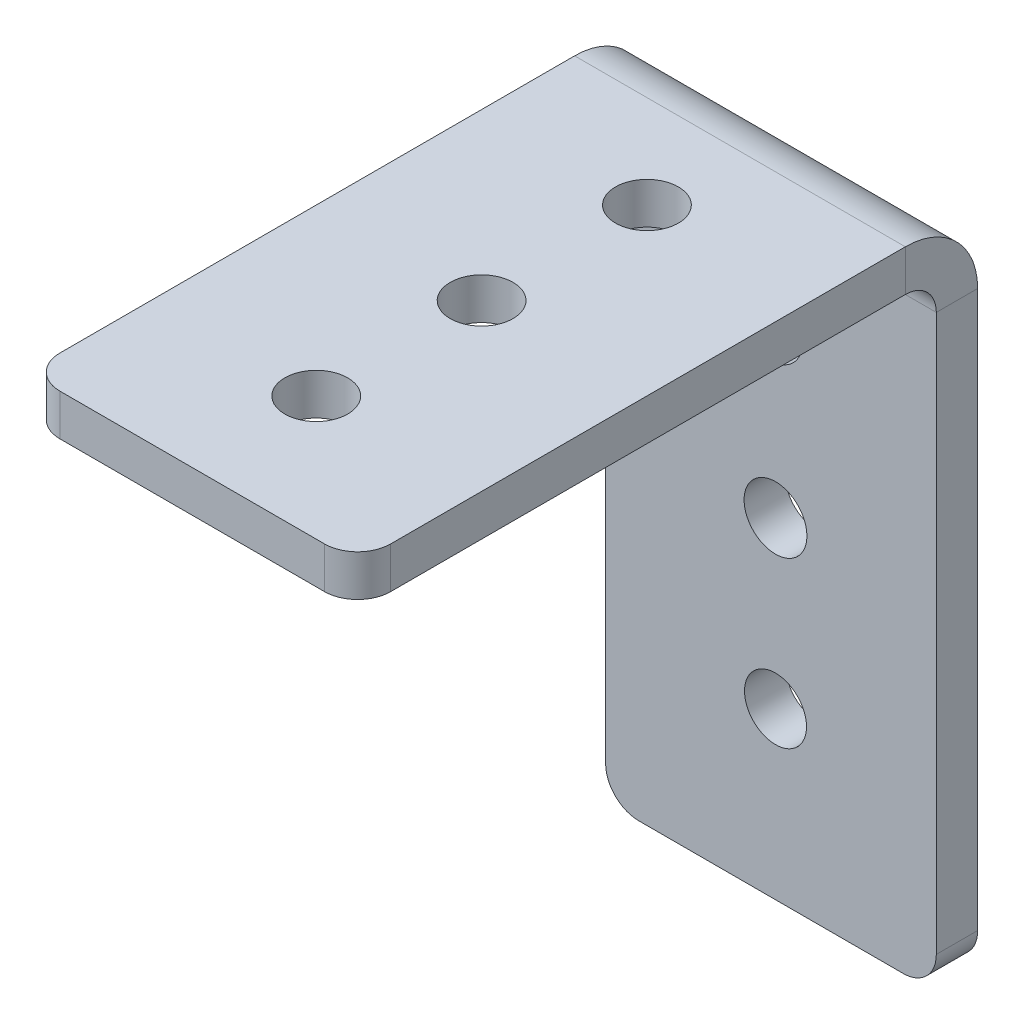
ISO-10303-21;
HEADER;
FILE_DESCRIPTION(('STEP AP214'),'2;1');
FILE_NAME('part.step','',(''),(''),'','','');
FILE_SCHEMA(('AUTOMOTIVE_DESIGN { 1 0 10303 214 1 1 1 1 }'));
ENDSEC;
DATA;
#1=APPLICATION_CONTEXT('core data for automotive mechanical design processes');
#2=APPLICATION_PROTOCOL_DEFINITION('international standard','automotive_design',2000,#1);
#3=PRODUCT_CONTEXT('',#1,'mechanical');
#4=PRODUCT('Part','Part','',(#3));
#5=PRODUCT_RELATED_PRODUCT_CATEGORY('part','',(#4));
#6=PRODUCT_DEFINITION_FORMATION('','',#4);
#7=PRODUCT_DEFINITION_CONTEXT('part definition',#1,'design');
#8=PRODUCT_DEFINITION('design','',#6,#7);
#9=PRODUCT_DEFINITION_SHAPE('','',#8);
#10=(LENGTH_UNIT() NAMED_UNIT(*) SI_UNIT(.MILLI.,.METRE.));
#11=(NAMED_UNIT(*) PLANE_ANGLE_UNIT() SI_UNIT($,.RADIAN.));
#12=(NAMED_UNIT(*) SI_UNIT($,.STERADIAN.) SOLID_ANGLE_UNIT());
#13=UNCERTAINTY_MEASURE_WITH_UNIT(LENGTH_MEASURE(1.E-05),#10,'distance_accuracy_value','');
#14=(GEOMETRIC_REPRESENTATION_CONTEXT(3) GLOBAL_UNCERTAINTY_ASSIGNED_CONTEXT((#13)) GLOBAL_UNIT_ASSIGNED_CONTEXT((#10,
#11,#12)) REPRESENTATION_CONTEXT('',''));
#15=CARTESIAN_POINT('',(0.,0.,0.));
#16=DIRECTION('',(0.,0.,1.));
#17=DIRECTION('',(1.,0.,0.));
#18=AXIS2_PLACEMENT_3D('',#15,#16,#17);
#19=CARTESIAN_POINT('',(12.7,22.225,47.625));
#20=DIRECTION('',(1.,0.,0.));
#21=DIRECTION('',(0.,0.,-1.));
#22=AXIS2_PLACEMENT_3D('',#19,#20,#21);
#23=PLANE('',#22);
#24=DIRECTION('',(0.,-1.,0.));
#25=VECTOR('',#24,1.);
#26=CARTESIAN_POINT('',(12.7,22.225,5.555000066));
#27=LINE('',#26,#25);
#28=CARTESIAN_POINT('',(12.7,25.4,5.555000066));
#29=VERTEX_POINT('',#28);
#30=CARTESIAN_POINT('',(12.7,22.225,5.555000066));
#31=VERTEX_POINT('',#30);
#32=EDGE_CURVE('E11',#29,#31,#27,.T.);
#33=ORIENTED_EDGE('',*,*,#32,.F.);
#34=DIRECTION('',(0.,0.,1.));
#35=VECTOR('',#34,1.);
#36=CARTESIAN_POINT('',(12.7,25.4,47.625));
#37=LINE('',#36,#35);
#38=CARTESIAN_POINT('',(12.7,25.4,45.085));
#39=VERTEX_POINT('',#38);
#40=EDGE_CURVE('E105',#39,#29,#37,.F.);
#41=ORIENTED_EDGE('',*,*,#40,.F.);
#42=DIRECTION('',(0.,-1.,0.));
#43=VECTOR('',#42,1.);
#44=CARTESIAN_POINT('',(12.7,22.225,45.085));
#45=LINE('',#44,#43);
#46=CARTESIAN_POINT('',(12.7,22.225,45.085));
#47=VERTEX_POINT('',#46);
#48=EDGE_CURVE('E53',#39,#47,#45,.T.);
#49=ORIENTED_EDGE('',*,*,#48,.T.);
#50=DIRECTION('',(0.,0.,-1.));
#51=VECTOR('',#50,1.);
#52=CARTESIAN_POINT('',(12.7,22.225,47.625));
#53=LINE('',#52,#51);
#54=EDGE_CURVE('E108',#47,#31,#53,.T.);
#55=ORIENTED_EDGE('',*,*,#54,.T.);
#56=EDGE_LOOP('',(#33,#41,#49,#55));
#57=FACE_BOUND('',#56,.T.);
#58=ADVANCED_FACE('F42',(#57),#23,.T.);
#59=CARTESIAN_POINT('',(10.16,22.225,45.085));
#60=DIRECTION('',(0.,1.,0.));
#61=DIRECTION('',(-1.,0.,0.));
#62=AXIS2_PLACEMENT_3D('',#59,#60,#61);
#63=CYLINDRICAL_SURFACE('',#62,2.54);
#64=ORIENTED_EDGE('',*,*,#48,.F.);
#65=CARTESIAN_POINT('',(10.16,25.4,45.085));
#66=DIRECTION('',(0.,1.,0.));
#67=DIRECTION('',(-1.,0.,0.));
#68=AXIS2_PLACEMENT_3D('',#65,#66,#67);
#69=CIRCLE('',#68,2.54);
#70=CARTESIAN_POINT('',(10.16,25.4,47.625));
#71=VERTEX_POINT('',#70);
#72=EDGE_CURVE('E135',#39,#71,#69,.F.);
#73=ORIENTED_EDGE('',*,*,#72,.T.);
#74=DIRECTION('',(0.,-1.,0.));
#75=VECTOR('',#74,1.);
#76=CARTESIAN_POINT('',(10.16,22.225,47.625));
#77=LINE('',#76,#75);
#78=CARTESIAN_POINT('',(10.16,22.225,47.625));
#79=VERTEX_POINT('',#78);
#80=EDGE_CURVE('E191',#71,#79,#77,.T.);
#81=ORIENTED_EDGE('',*,*,#80,.T.);
#82=CARTESIAN_POINT('',(10.16,22.225,45.085));
#83=DIRECTION('',(0.,1.,0.));
#84=DIRECTION('',(-1.,0.,0.));
#85=AXIS2_PLACEMENT_3D('',#82,#83,#84);
#86=CIRCLE('',#85,2.54);
#87=EDGE_CURVE('E207',#47,#79,#86,.F.);
#88=ORIENTED_EDGE('',*,*,#87,.F.);
#89=EDGE_LOOP('',(#64,#73,#81,#88));
#90=FACE_BOUND('',#89,.T.);
#91=ADVANCED_FACE('F214',(#90),#63,.T.);
#92=CARTESIAN_POINT('',(-12.7,22.225,47.625));
#93=DIRECTION('',(0.,0.,1.));
#94=DIRECTION('',(1.,0.,0.));
#95=AXIS2_PLACEMENT_3D('',#92,#93,#94);
#96=PLANE('',#95);
#97=ORIENTED_EDGE('',*,*,#80,.F.);
#98=DIRECTION('',(-1.,0.,0.));
#99=VECTOR('',#98,1.);
#100=CARTESIAN_POINT('',(-12.7,25.4,47.625));
#101=LINE('',#100,#99);
#102=CARTESIAN_POINT('',(-10.16,25.4,47.625));
#103=VERTEX_POINT('',#102);
#104=EDGE_CURVE('E309',#103,#71,#101,.F.);
#105=ORIENTED_EDGE('',*,*,#104,.F.);
#106=DIRECTION('',(0.,-1.,0.));
#107=VECTOR('',#106,1.);
#108=CARTESIAN_POINT('',(-10.16,22.225,47.625));
#109=LINE('',#108,#107);
#110=CARTESIAN_POINT('',(-10.16,22.225,47.625));
#111=VERTEX_POINT('',#110);
#112=EDGE_CURVE('E187',#103,#111,#109,.T.);
#113=ORIENTED_EDGE('',*,*,#112,.T.);
#114=DIRECTION('',(1.,0.,0.));
#115=VECTOR('',#114,1.);
#116=CARTESIAN_POINT('',(-12.7,22.225,47.625));
#117=LINE('',#116,#115);
#118=EDGE_CURVE('E215',#111,#79,#117,.T.);
#119=ORIENTED_EDGE('',*,*,#118,.T.);
#120=EDGE_LOOP('',(#97,#105,#113,#119));
#121=FACE_BOUND('',#120,.T.);
#122=ADVANCED_FACE('F315',(#121),#96,.T.);
#123=CARTESIAN_POINT('',(-10.16,22.225,45.085));
#124=DIRECTION('',(0.,1.,0.));
#125=DIRECTION('',(-1.,0.,0.));
#126=AXIS2_PLACEMENT_3D('',#123,#124,#125);
#127=CYLINDRICAL_SURFACE('',#126,2.54);
#128=ORIENTED_EDGE('',*,*,#112,.F.);
#129=CARTESIAN_POINT('',(-10.16,25.4,45.085));
#130=DIRECTION('',(0.,1.,0.));
#131=DIRECTION('',(-1.,0.,0.));
#132=AXIS2_PLACEMENT_3D('',#129,#130,#131);
#133=CIRCLE('',#132,2.54);
#134=CARTESIAN_POINT('',(-12.7,25.4,45.085));
#135=VERTEX_POINT('',#134);
#136=EDGE_CURVE('E305',#103,#135,#133,.F.);
#137=ORIENTED_EDGE('',*,*,#136,.T.);
#138=DIRECTION('',(0.,-1.,0.));
#139=VECTOR('',#138,1.);
#140=CARTESIAN_POINT('',(-12.7,22.225,45.085));
#141=LINE('',#140,#139);
#142=CARTESIAN_POINT('',(-12.7,22.225,45.085));
#143=VERTEX_POINT('',#142);
#144=EDGE_CURVE('E183',#135,#143,#141,.T.);
#145=ORIENTED_EDGE('',*,*,#144,.T.);
#146=CARTESIAN_POINT('',(-10.16,22.225,45.085));
#147=DIRECTION('',(0.,1.,0.));
#148=DIRECTION('',(-1.,0.,0.));
#149=AXIS2_PLACEMENT_3D('',#146,#147,#148);
#150=CIRCLE('',#149,2.54);
#151=EDGE_CURVE('E217',#111,#143,#150,.F.);
#152=ORIENTED_EDGE('',*,*,#151,.F.);
#153=EDGE_LOOP('',(#128,#137,#145,#152));
#154=FACE_BOUND('',#153,.T.);
#155=ADVANCED_FACE('F323',(#154),#127,.T.);
#156=CARTESIAN_POINT('',(-12.7,22.225,47.625));
#157=DIRECTION('',(1.,0.,0.));
#158=DIRECTION('',(0.,0.,-1.));
#159=AXIS2_PLACEMENT_3D('',#156,#157,#158);
#160=PLANE('',#159);
#161=ORIENTED_EDGE('',*,*,#144,.F.);
#162=DIRECTION('',(0.,0.,1.));
#163=VECTOR('',#162,1.);
#164=CARTESIAN_POINT('',(-12.7,25.4,47.625));
#165=LINE('',#164,#163);
#166=CARTESIAN_POINT('',(-12.7,25.4,5.555000066));
#167=VERTEX_POINT('',#166);
#168=EDGE_CURVE('E277',#135,#167,#165,.F.);
#169=ORIENTED_EDGE('',*,*,#168,.T.);
#170=DIRECTION('',(0.,-1.,0.));
#171=VECTOR('',#170,1.);
#172=CARTESIAN_POINT('',(-12.7,22.225,5.555000066));
#173=LINE('',#172,#171);
#174=CARTESIAN_POINT('',(-12.7,22.225,5.555000066));
#175=VERTEX_POINT('',#174);
#176=EDGE_CURVE('E179',#167,#175,#173,.T.);
#177=ORIENTED_EDGE('',*,*,#176,.T.);
#178=DIRECTION('',(0.,0.,-1.));
#179=VECTOR('',#178,1.);
#180=CARTESIAN_POINT('',(-12.7,22.225,47.625));
#181=LINE('',#180,#179);
#182=EDGE_CURVE('E224',#143,#175,#181,.T.);
#183=ORIENTED_EDGE('',*,*,#182,.F.);
#184=EDGE_LOOP('',(#161,#169,#177,#183));
#185=FACE_BOUND('',#184,.T.);
#186=ADVANCED_FACE('F327',(#185),#160,.F.);
#187=CARTESIAN_POINT('',(-12.7,19.844999934,5.555000066));
#188=DIRECTION('',(-1.,0.,0.));
#189=DIRECTION('',(0.,0.,1.));
#190=AXIS2_PLACEMENT_3D('',#187,#188,#189);
#191=PLANE('',#190);
#192=ORIENTED_EDGE('',*,*,#176,.F.);
#193=CARTESIAN_POINT('',(-12.7,19.844999934,5.555000066));
#194=DIRECTION('',(-1.,0.,0.));
#195=DIRECTION('',(0.,-1.,0.));
#196=AXIS2_PLACEMENT_3D('',#193,#194,#195);
#197=CIRCLE('',#196,5.555000066);
#198=CARTESIAN_POINT('',(-12.7,19.844999934,0.));
#199=VERTEX_POINT('',#198);
#200=EDGE_CURVE('E123',#167,#199,#197,.T.);
#201=ORIENTED_EDGE('',*,*,#200,.T.);
#202=DIRECTION('',(0.,0.,1.));
#203=VECTOR('',#202,1.);
#204=CARTESIAN_POINT('',(-12.7,19.844999934,3.175));
#205=LINE('',#204,#203);
#206=CARTESIAN_POINT('',(-12.7,19.844999934,3.175));
#207=VERTEX_POINT('',#206);
#208=EDGE_CURVE('E61',#199,#207,#205,.T.);
#209=ORIENTED_EDGE('',*,*,#208,.T.);
#210=CARTESIAN_POINT('',(-12.7,19.844999934,5.555000066));
#211=DIRECTION('',(1.,0.,0.));
#212=DIRECTION('',(0.,0.,-1.));
#213=AXIS2_PLACEMENT_3D('',#210,#211,#212);
#214=CIRCLE('',#213,2.380000066);
#215=EDGE_CURVE('E266',#175,#207,#214,.F.);
#216=ORIENTED_EDGE('',*,*,#215,.F.);
#217=EDGE_LOOP('',(#192,#201,#209,#216));
#218=FACE_BOUND('',#217,.T.);
#219=ADVANCED_FACE('F328',(#218),#191,.T.);
#220=CARTESIAN_POINT('',(-12.7,-25.4,3.175));
#221=DIRECTION('',(1.,0.,0.));
#222=DIRECTION('',(0.,-1.,0.));
#223=AXIS2_PLACEMENT_3D('',#220,#221,#222);
#224=PLANE('',#223);
#225=ORIENTED_EDGE('',*,*,#208,.F.);
#226=DIRECTION('',(0.,1.,0.));
#227=VECTOR('',#226,1.);
#228=CARTESIAN_POINT('',(-12.7,0.,0.));
#229=LINE('',#228,#227);
#230=CARTESIAN_POINT('',(-12.7,-22.86,0.));
#231=VERTEX_POINT('',#230);
#232=EDGE_CURVE('E289',#199,#231,#229,.F.);
#233=ORIENTED_EDGE('',*,*,#232,.T.);
#234=DIRECTION('',(0.,0.,1.));
#235=VECTOR('',#234,1.);
#236=CARTESIAN_POINT('',(-12.7,-22.86,3.175));
#237=LINE('',#236,#235);
#238=CARTESIAN_POINT('',(-12.7,-22.86,3.175));
#239=VERTEX_POINT('',#238);
#240=EDGE_CURVE('E173',#231,#239,#237,.T.);
#241=ORIENTED_EDGE('',*,*,#240,.T.);
#242=DIRECTION('',(0.,-1.,0.));
#243=VECTOR('',#242,1.);
#244=CARTESIAN_POINT('',(-12.7,-25.4,3.175));
#245=LINE('',#244,#243);
#246=EDGE_CURVE('E250',#207,#239,#245,.T.);
#247=ORIENTED_EDGE('',*,*,#246,.F.);
#248=EDGE_LOOP('',(#225,#233,#241,#247));
#249=FACE_BOUND('',#248,.T.);
#250=ADVANCED_FACE('F361',(#249),#224,.F.);
#251=CARTESIAN_POINT('',(-10.16,-22.86,3.175));
#252=DIRECTION('',(0.,0.,-1.));
#253=DIRECTION('',(-1.,0.,0.));
#254=AXIS2_PLACEMENT_3D('',#251,#252,#253);
#255=CYLINDRICAL_SURFACE('',#254,2.54);
#256=ORIENTED_EDGE('',*,*,#240,.F.);
#257=CARTESIAN_POINT('',(-10.16,-22.86,0.));
#258=DIRECTION('',(0.,0.,-1.));
#259=DIRECTION('',(-1.,0.,0.));
#260=AXIS2_PLACEMENT_3D('',#257,#258,#259);
#261=CIRCLE('',#260,2.54);
#262=CARTESIAN_POINT('',(-10.16,-25.4,0.));
#263=VERTEX_POINT('',#262);
#264=EDGE_CURVE('E129',#231,#263,#261,.F.);
#265=ORIENTED_EDGE('',*,*,#264,.T.);
#266=DIRECTION('',(0.,0.,1.));
#267=VECTOR('',#266,1.);
#268=CARTESIAN_POINT('',(-10.16,-25.4,3.175));
#269=LINE('',#268,#267);
#270=CARTESIAN_POINT('',(-10.16,-25.4,3.175));
#271=VERTEX_POINT('',#270);
#272=EDGE_CURVE('E169',#263,#271,#269,.T.);
#273=ORIENTED_EDGE('',*,*,#272,.T.);
#274=CARTESIAN_POINT('',(-10.16,-22.86,3.175));
#275=DIRECTION('',(0.,0.,-1.));
#276=DIRECTION('',(-1.,0.,0.));
#277=AXIS2_PLACEMENT_3D('',#274,#275,#276);
#278=CIRCLE('',#277,2.54);
#279=EDGE_CURVE('E254',#239,#271,#278,.F.);
#280=ORIENTED_EDGE('',*,*,#279,.F.);
#281=EDGE_LOOP('',(#256,#265,#273,#280));
#282=FACE_BOUND('',#281,.T.);
#283=ADVANCED_FACE('F363',(#282),#255,.T.);
#284=CARTESIAN_POINT('',(-12.7,-25.4,3.175));
#285=DIRECTION('',(0.,1.,0.));
#286=DIRECTION('',(1.,0.,0.));
#287=AXIS2_PLACEMENT_3D('',#284,#285,#286);
#288=PLANE('',#287);
#289=ORIENTED_EDGE('',*,*,#272,.F.);
#290=DIRECTION('',(-1.,0.,0.));
#291=VECTOR('',#290,1.);
#292=CARTESIAN_POINT('',(0.,-25.4,0.));
#293=LINE('',#292,#291);
#294=CARTESIAN_POINT('',(10.16,-25.4,0.));
#295=VERTEX_POINT('',#294);
#296=EDGE_CURVE('E285',#263,#295,#293,.F.);
#297=ORIENTED_EDGE('',*,*,#296,.T.);
#298=DIRECTION('',(0.,0.,1.));
#299=VECTOR('',#298,1.);
#300=CARTESIAN_POINT('',(10.16,-25.4,3.175));
#301=LINE('',#300,#299);
#302=CARTESIAN_POINT('',(10.16,-25.4,3.175));
#303=VERTEX_POINT('',#302);
#304=EDGE_CURVE('E165',#295,#303,#301,.T.);
#305=ORIENTED_EDGE('',*,*,#304,.T.);
#306=DIRECTION('',(1.,0.,0.));
#307=VECTOR('',#306,1.);
#308=CARTESIAN_POINT('',(-12.7,-25.4,3.175));
#309=LINE('',#308,#307);
#310=EDGE_CURVE('E239',#271,#303,#309,.T.);
#311=ORIENTED_EDGE('',*,*,#310,.F.);
#312=EDGE_LOOP('',(#289,#297,#305,#311));
#313=FACE_BOUND('',#312,.T.);
#314=ADVANCED_FACE('F343',(#313),#288,.F.);
#315=CARTESIAN_POINT('',(10.16,-22.86,3.175));
#316=DIRECTION('',(0.,0.,-1.));
#317=DIRECTION('',(-1.,0.,0.));
#318=AXIS2_PLACEMENT_3D('',#315,#316,#317);
#319=CYLINDRICAL_SURFACE('',#318,2.54);
#320=ORIENTED_EDGE('',*,*,#304,.F.);
#321=CARTESIAN_POINT('',(10.16,-22.86,0.));
#322=DIRECTION('',(0.,0.,-1.));
#323=DIRECTION('',(-1.,0.,0.));
#324=AXIS2_PLACEMENT_3D('',#321,#322,#323);
#325=CIRCLE('',#324,2.54);
#326=CARTESIAN_POINT('',(12.7,-22.86,0.));
#327=VERTEX_POINT('',#326);
#328=EDGE_CURVE('E290',#295,#327,#325,.F.);
#329=ORIENTED_EDGE('',*,*,#328,.T.);
#330=DIRECTION('',(0.,0.,1.));
#331=VECTOR('',#330,1.);
#332=CARTESIAN_POINT('',(12.7,-22.86,3.175));
#333=LINE('',#332,#331);
#334=CARTESIAN_POINT('',(12.7,-22.86,3.175));
#335=VERTEX_POINT('',#334);
#336=EDGE_CURVE('E161',#327,#335,#333,.T.);
#337=ORIENTED_EDGE('',*,*,#336,.T.);
#338=CARTESIAN_POINT('',(10.16,-22.86,3.175));
#339=DIRECTION('',(0.,0.,-1.));
#340=DIRECTION('',(-1.,0.,0.));
#341=AXIS2_PLACEMENT_3D('',#338,#339,#340);
#342=CIRCLE('',#341,2.54);
#343=EDGE_CURVE('E243',#303,#335,#342,.F.);
#344=ORIENTED_EDGE('',*,*,#343,.F.);
#345=EDGE_LOOP('',(#320,#329,#337,#344));
#346=FACE_BOUND('',#345,.T.);
#347=ADVANCED_FACE('F352',(#346),#319,.T.);
#348=CARTESIAN_POINT('',(12.7,-25.4,3.175));
#349=DIRECTION('',(-1.,0.,0.));
#350=DIRECTION('',(0.,1.,0.));
#351=AXIS2_PLACEMENT_3D('',#348,#349,#350);
#352=PLANE('',#351);
#353=ORIENTED_EDGE('',*,*,#336,.F.);
#354=DIRECTION('',(0.,1.,0.));
#355=VECTOR('',#354,1.);
#356=CARTESIAN_POINT('',(12.7,0.,0.));
#357=LINE('',#356,#355);
#358=CARTESIAN_POINT('',(12.7,19.844999934,0.));
#359=VERTEX_POINT('',#358);
#360=EDGE_CURVE('E286',#327,#359,#357,.T.);
#361=ORIENTED_EDGE('',*,*,#360,.T.);
#362=DIRECTION('',(0.,0.,1.));
#363=VECTOR('',#362,1.);
#364=CARTESIAN_POINT('',(12.7,19.844999934,3.175));
#365=LINE('',#364,#363);
#366=CARTESIAN_POINT('',(12.7,19.844999934,3.175));
#367=VERTEX_POINT('',#366);
#368=EDGE_CURVE('E46',#359,#367,#365,.T.);
#369=ORIENTED_EDGE('',*,*,#368,.T.);
#370=DIRECTION('',(0.,1.,0.));
#371=VECTOR('',#370,1.);
#372=CARTESIAN_POINT('',(12.7,-25.4,3.175));
#373=LINE('',#372,#371);
#374=EDGE_CURVE('E246',#335,#367,#373,.T.);
#375=ORIENTED_EDGE('',*,*,#374,.F.);
#376=EDGE_LOOP('',(#353,#361,#369,#375));
#377=FACE_BOUND('',#376,.T.);
#378=ADVANCED_FACE('F355',(#377),#352,.F.);
#379=CARTESIAN_POINT('',(0.,22.225,12.7));
#380=DIRECTION('',(0.,1.,0.));
#381=DIRECTION('',(-1.,0.,0.));
#382=AXIS2_PLACEMENT_3D('',#379,#380,#381);
#383=CYLINDRICAL_SURFACE('',#382,2.413);
#384=CARTESIAN_POINT('',(0.,22.225,12.7));
#385=DIRECTION('',(0.,1.,0.));
#386=DIRECTION('',(-1.,0.,0.));
#387=AXIS2_PLACEMENT_3D('',#384,#385,#386);
#388=CIRCLE('',#387,2.413);
#389=CARTESIAN_POINT('',(-2.413,22.225,12.7));
#390=VERTEX_POINT('',#389);
#391=EDGE_CURVE('E269',#390,#390,#388,.T.);
#392=ORIENTED_EDGE('',*,*,#391,.F.);
#393=EDGE_LOOP('',(#392));
#394=FACE_BOUND('',#393,.T.);
#395=CARTESIAN_POINT('',(0.,25.4,12.7));
#396=DIRECTION('',(0.,1.,0.));
#397=DIRECTION('',(-1.,0.,0.));
#398=AXIS2_PLACEMENT_3D('',#395,#396,#397);
#399=CIRCLE('',#398,2.413);
#400=CARTESIAN_POINT('',(-2.413,25.4,12.7));
#401=VERTEX_POINT('',#400);
#402=EDGE_CURVE('E147',#401,#401,#399,.T.);
#403=ORIENTED_EDGE('',*,*,#402,.T.);
#404=EDGE_LOOP('',(#403));
#405=FACE_BOUND('',#404,.T.);
#406=ADVANCED_FACE('F381',(#394,#405),#383,.F.);
#407=CARTESIAN_POINT('',(0.,22.225,25.4));
#408=DIRECTION('',(0.,1.,0.));
#409=DIRECTION('',(-1.,0.,0.));
#410=AXIS2_PLACEMENT_3D('',#407,#408,#409);
#411=CYLINDRICAL_SURFACE('',#410,2.413);
#412=CARTESIAN_POINT('',(0.,22.225,25.4));
#413=DIRECTION('',(0.,1.,0.));
#414=DIRECTION('',(-1.,0.,0.));
#415=AXIS2_PLACEMENT_3D('',#412,#413,#414);
#416=CIRCLE('',#415,2.413);
#417=CARTESIAN_POINT('',(-2.413,22.225,25.4));
#418=VERTEX_POINT('',#417);
#419=EDGE_CURVE('E394',#418,#418,#416,.T.);
#420=ORIENTED_EDGE('',*,*,#419,.F.);
#421=EDGE_LOOP('',(#420));
#422=FACE_BOUND('',#421,.T.);
#423=CARTESIAN_POINT('',(0.,25.4,25.4));
#424=DIRECTION('',(0.,1.,0.));
#425=DIRECTION('',(-1.,0.,0.));
#426=AXIS2_PLACEMENT_3D('',#423,#424,#425);
#427=CIRCLE('',#426,2.413);
#428=CARTESIAN_POINT('',(-2.413,25.4,25.4));
#429=VERTEX_POINT('',#428);
#430=EDGE_CURVE('E154',#429,#429,#427,.T.);
#431=ORIENTED_EDGE('',*,*,#430,.T.);
#432=EDGE_LOOP('',(#431));
#433=FACE_BOUND('',#432,.T.);
#434=ADVANCED_FACE('F383',(#422,#433),#411,.F.);
#435=CARTESIAN_POINT('',(0.,22.225,38.1));
#436=DIRECTION('',(0.,1.,0.));
#437=DIRECTION('',(-1.,0.,0.));
#438=AXIS2_PLACEMENT_3D('',#435,#436,#437);
#439=CYLINDRICAL_SURFACE('',#438,2.413);
#440=CARTESIAN_POINT('',(0.,22.225,38.1));
#441=DIRECTION('',(0.,1.,0.));
#442=DIRECTION('',(-1.,0.,0.));
#443=AXIS2_PLACEMENT_3D('',#440,#441,#442);
#444=CIRCLE('',#443,2.413);
#445=CARTESIAN_POINT('',(-2.413,22.225,38.1));
#446=VERTEX_POINT('',#445);
#447=EDGE_CURVE('E212',#446,#446,#444,.T.);
#448=ORIENTED_EDGE('',*,*,#447,.F.);
#449=EDGE_LOOP('',(#448));
#450=FACE_BOUND('',#449,.T.);
#451=CARTESIAN_POINT('',(0.,25.4,38.1));
#452=DIRECTION('',(0.,1.,0.));
#453=DIRECTION('',(-1.,0.,0.));
#454=AXIS2_PLACEMENT_3D('',#451,#452,#453);
#455=CIRCLE('',#454,2.413);
#456=CARTESIAN_POINT('',(-2.413,25.4,38.1));
#457=VERTEX_POINT('',#456);
#458=EDGE_CURVE('E137',#457,#457,#455,.T.);
#459=ORIENTED_EDGE('',*,*,#458,.T.);
#460=EDGE_LOOP('',(#459));
#461=FACE_BOUND('',#460,.T.);
#462=ADVANCED_FACE('F44',(#450,#461),#439,.F.);
#463=CARTESIAN_POINT('',(0.348627450980399,-12.7,3.175));
#464=DIRECTION('',(0.,0.,-1.));
#465=DIRECTION('',(-1.,0.,0.));
#466=AXIS2_PLACEMENT_3D('',#463,#464,#465);
#467=CYLINDRICAL_SURFACE('',#466,2.38125);
#468=CARTESIAN_POINT('',(0.348627450980399,-12.7,3.175));
#469=DIRECTION('',(0.,0.,1.));
#470=DIRECTION('',(1.,0.,0.));
#471=AXIS2_PLACEMENT_3D('',#468,#469,#470);
#472=CIRCLE('',#471,2.38125);
#473=CARTESIAN_POINT('',(2.7298774509804,-12.7,3.175));
#474=VERTEX_POINT('',#473);
#475=EDGE_CURVE('E227',#474,#474,#472,.T.);
#476=ORIENTED_EDGE('',*,*,#475,.T.);
#477=EDGE_LOOP('',(#476));
#478=FACE_BOUND('',#477,.T.);
#479=CARTESIAN_POINT('',(0.348627450980399,-12.7,0.));
#480=DIRECTION('',(0.,0.,1.));
#481=DIRECTION('',(1.,0.,0.));
#482=AXIS2_PLACEMENT_3D('',#479,#480,#481);
#483=CIRCLE('',#482,2.38125);
#484=CARTESIAN_POINT('',(2.7298774509804,-12.7,0.));
#485=VERTEX_POINT('',#484);
#486=EDGE_CURVE('E272',#485,#485,#483,.T.);
#487=ORIENTED_EDGE('',*,*,#486,.F.);
#488=EDGE_LOOP('',(#487));
#489=FACE_BOUND('',#488,.T.);
#490=ADVANCED_FACE('F389',(#478,#489),#467,.F.);
#491=CARTESIAN_POINT('',(0.348627450980399,0.,3.175));
#492=DIRECTION('',(0.,0.,-1.));
#493=DIRECTION('',(-1.,0.,0.));
#494=AXIS2_PLACEMENT_3D('',#491,#492,#493);
#495=CYLINDRICAL_SURFACE('',#494,2.413);
#496=CARTESIAN_POINT('',(0.348627450980399,0.,3.175));
#497=DIRECTION('',(0.,0.,1.));
#498=DIRECTION('',(1.,0.,0.));
#499=AXIS2_PLACEMENT_3D('',#496,#497,#498);
#500=CIRCLE('',#499,2.413);
#501=CARTESIAN_POINT('',(2.7616274509804,0.,3.175));
#502=VERTEX_POINT('',#501);
#503=EDGE_CURVE('E231',#502,#502,#500,.T.);
#504=ORIENTED_EDGE('',*,*,#503,.T.);
#505=EDGE_LOOP('',(#504));
#506=FACE_BOUND('',#505,.T.);
#507=CARTESIAN_POINT('',(0.348627450980399,0.,0.));
#508=DIRECTION('',(0.,0.,1.));
#509=DIRECTION('',(1.,0.,0.));
#510=AXIS2_PLACEMENT_3D('',#507,#508,#509);
#511=CIRCLE('',#510,2.413);
#512=CARTESIAN_POINT('',(2.7616274509804,0.,0.));
#513=VERTEX_POINT('',#512);
#514=EDGE_CURVE('E276',#513,#513,#511,.T.);
#515=ORIENTED_EDGE('',*,*,#514,.F.);
#516=EDGE_LOOP('',(#515));
#517=FACE_BOUND('',#516,.T.);
#518=ADVANCED_FACE('F414',(#506,#517),#495,.F.);
#519=CARTESIAN_POINT('',(0.,12.7,3.175));
#520=DIRECTION('',(0.,0.,-1.));
#521=DIRECTION('',(-1.,0.,0.));
#522=AXIS2_PLACEMENT_3D('',#519,#520,#521);
#523=CYLINDRICAL_SURFACE('',#522,2.413);
#524=CARTESIAN_POINT('',(0.,12.7,3.175));
#525=DIRECTION('',(0.,0.,1.));
#526=DIRECTION('',(1.,0.,0.));
#527=AXIS2_PLACEMENT_3D('',#524,#525,#526);
#528=CIRCLE('',#527,2.413);
#529=CARTESIAN_POINT('',(2.413,12.7,3.175));
#530=VERTEX_POINT('',#529);
#531=EDGE_CURVE('E235',#530,#530,#528,.T.);
#532=ORIENTED_EDGE('',*,*,#531,.T.);
#533=EDGE_LOOP('',(#532));
#534=FACE_BOUND('',#533,.T.);
#535=CARTESIAN_POINT('',(0.,12.7,0.));
#536=DIRECTION('',(0.,0.,1.));
#537=DIRECTION('',(1.,0.,0.));
#538=AXIS2_PLACEMENT_3D('',#535,#536,#537);
#539=CIRCLE('',#538,2.413);
#540=CARTESIAN_POINT('',(2.413,12.7,0.));
#541=VERTEX_POINT('',#540);
#542=EDGE_CURVE('E281',#541,#541,#539,.T.);
#543=ORIENTED_EDGE('',*,*,#542,.F.);
#544=EDGE_LOOP('',(#543));
#545=FACE_BOUND('',#544,.T.);
#546=ADVANCED_FACE('F380',(#534,#545),#523,.F.);
#547=CARTESIAN_POINT('',(12.7,19.844999934,5.555000066));
#548=DIRECTION('',(-1.,0.,0.));
#549=DIRECTION('',(0.,0.,1.));
#550=AXIS2_PLACEMENT_3D('',#547,#548,#549);
#551=PLANE('',#550);
#552=CARTESIAN_POINT('',(12.7,19.844999934,5.555000066));
#553=DIRECTION('',(-1.,0.,0.));
#554=DIRECTION('',(0.,-1.,0.));
#555=AXIS2_PLACEMENT_3D('',#552,#553,#554);
#556=CIRCLE('',#555,5.555000066);
#557=EDGE_CURVE('E121',#359,#29,#556,.F.);
#558=ORIENTED_EDGE('',*,*,#557,.T.);
#559=ORIENTED_EDGE('',*,*,#32,.T.);
#560=CARTESIAN_POINT('',(12.7,19.844999934,5.555000066));
#561=DIRECTION('',(1.,0.,0.));
#562=DIRECTION('',(0.,0.,-1.));
#563=AXIS2_PLACEMENT_3D('',#560,#561,#562);
#564=CIRCLE('',#563,2.380000066);
#565=EDGE_CURVE('E263',#367,#31,#564,.T.);
#566=ORIENTED_EDGE('',*,*,#565,.F.);
#567=ORIENTED_EDGE('',*,*,#368,.F.);
#568=EDGE_LOOP('',(#558,#559,#566,#567));
#569=FACE_BOUND('',#568,.T.);
#570=ADVANCED_FACE('F140',(#569),#551,.F.);
#571=CARTESIAN_POINT('',(0.,0.,3.175));
#572=DIRECTION('',(0.,0.,-1.));
#573=DIRECTION('',(-1.,0.,0.));
#574=AXIS2_PLACEMENT_3D('',#571,#572,#573);
#575=PLANE('',#574);
#576=ORIENTED_EDGE('',*,*,#475,.F.);
#577=EDGE_LOOP('',(#576));
#578=FACE_BOUND('',#577,.T.);
#579=ORIENTED_EDGE('',*,*,#503,.F.);
#580=EDGE_LOOP('',(#579));
#581=FACE_BOUND('',#580,.T.);
#582=ORIENTED_EDGE('',*,*,#531,.F.);
#583=EDGE_LOOP('',(#582));
#584=FACE_BOUND('',#583,.T.);
#585=ORIENTED_EDGE('',*,*,#374,.T.);
#586=DIRECTION('',(1.,0.,0.));
#587=VECTOR('',#586,1.);
#588=CARTESIAN_POINT('',(-12.7,19.844999934,3.175));
#589=LINE('',#588,#587);
#590=EDGE_CURVE('E259',#367,#207,#589,.F.);
#591=ORIENTED_EDGE('',*,*,#590,.T.);
#592=ORIENTED_EDGE('',*,*,#246,.T.);
#593=ORIENTED_EDGE('',*,*,#279,.T.);
#594=ORIENTED_EDGE('',*,*,#310,.T.);
#595=ORIENTED_EDGE('',*,*,#343,.T.);
#596=EDGE_LOOP('',(#585,#591,#592,#593,#594,#595));
#597=FACE_BOUND('',#596,.T.);
#598=ADVANCED_FACE('F349',(#578,#581,#584,#597),#575,.F.);
#599=CARTESIAN_POINT('',(-12.7,22.225,47.625));
#600=DIRECTION('',(0.,1.,0.));
#601=DIRECTION('',(-1.,0.,0.));
#602=AXIS2_PLACEMENT_3D('',#599,#600,#601);
#603=PLANE('',#602);
#604=ORIENTED_EDGE('',*,*,#391,.T.);
#605=EDGE_LOOP('',(#604));
#606=FACE_BOUND('',#605,.T.);
#607=ORIENTED_EDGE('',*,*,#419,.T.);
#608=EDGE_LOOP('',(#607));
#609=FACE_BOUND('',#608,.T.);
#610=ORIENTED_EDGE('',*,*,#447,.T.);
#611=EDGE_LOOP('',(#610));
#612=FACE_BOUND('',#611,.T.);
#613=ORIENTED_EDGE('',*,*,#182,.T.);
#614=DIRECTION('',(1.,0.,0.));
#615=VECTOR('',#614,1.);
#616=CARTESIAN_POINT('',(12.7,22.225,5.555000066));
#617=LINE('',#616,#615);
#618=EDGE_CURVE('E210',#175,#31,#617,.T.);
#619=ORIENTED_EDGE('',*,*,#618,.T.);
#620=ORIENTED_EDGE('',*,*,#54,.F.);
#621=ORIENTED_EDGE('',*,*,#87,.T.);
#622=ORIENTED_EDGE('',*,*,#118,.F.);
#623=ORIENTED_EDGE('',*,*,#151,.T.);
#624=EDGE_LOOP('',(#613,#619,#620,#621,#622,#623));
#625=FACE_BOUND('',#624,.T.);
#626=ADVANCED_FACE('F205',(#606,#609,#612,#625),#603,.F.);
#627=CARTESIAN_POINT('',(-12.7,19.844999934,5.555000066));
#628=DIRECTION('',(-1.,0.,0.));
#629=DIRECTION('',(0.,-1.,0.));
#630=AXIS2_PLACEMENT_3D('',#627,#628,#629);
#631=CYLINDRICAL_SURFACE('',#630,2.380000066);
#632=ORIENTED_EDGE('',*,*,#215,.T.);
#633=ORIENTED_EDGE('',*,*,#590,.F.);
#634=ORIENTED_EDGE('',*,*,#565,.T.);
#635=ORIENTED_EDGE('',*,*,#618,.F.);
#636=EDGE_LOOP('',(#632,#633,#634,#635));
#637=FACE_BOUND('',#636,.T.);
#638=ADVANCED_FACE('F332',(#637),#631,.F.);
#639=CARTESIAN_POINT('',(0.,0.,0.));
#640=DIRECTION('',(0.,0.,-1.));
#641=DIRECTION('',(-1.,0.,0.));
#642=AXIS2_PLACEMENT_3D('',#639,#640,#641);
#643=PLANE('',#642);
#644=ORIENTED_EDGE('',*,*,#486,.T.);
#645=EDGE_LOOP('',(#644));
#646=FACE_BOUND('',#645,.T.);
#647=ORIENTED_EDGE('',*,*,#514,.T.);
#648=EDGE_LOOP('',(#647));
#649=FACE_BOUND('',#648,.T.);
#650=ORIENTED_EDGE('',*,*,#542,.T.);
#651=EDGE_LOOP('',(#650));
#652=FACE_BOUND('',#651,.T.);
#653=ORIENTED_EDGE('',*,*,#360,.F.);
#654=ORIENTED_EDGE('',*,*,#328,.F.);
#655=ORIENTED_EDGE('',*,*,#296,.F.);
#656=ORIENTED_EDGE('',*,*,#264,.F.);
#657=ORIENTED_EDGE('',*,*,#232,.F.);
#658=DIRECTION('',(-1.,0.,0.));
#659=VECTOR('',#658,1.);
#660=CARTESIAN_POINT('',(0.,19.844999934,0.));
#661=LINE('',#660,#659);
#662=EDGE_CURVE('E128',#359,#199,#661,.T.);
#663=ORIENTED_EDGE('',*,*,#662,.F.);
#664=EDGE_LOOP('',(#653,#654,#655,#656,#657,#663));
#665=FACE_BOUND('',#664,.T.);
#666=ADVANCED_FACE('F357',(#646,#649,#652,#665),#643,.T.);
#667=CARTESIAN_POINT('',(-12.7,25.4,47.625));
#668=DIRECTION('',(0.,1.,0.));
#669=DIRECTION('',(-1.,0.,0.));
#670=AXIS2_PLACEMENT_3D('',#667,#668,#669);
#671=PLANE('',#670);
#672=ORIENTED_EDGE('',*,*,#402,.F.);
#673=EDGE_LOOP('',(#672));
#674=FACE_BOUND('',#673,.T.);
#675=ORIENTED_EDGE('',*,*,#430,.F.);
#676=EDGE_LOOP('',(#675));
#677=FACE_BOUND('',#676,.T.);
#678=ORIENTED_EDGE('',*,*,#458,.F.);
#679=EDGE_LOOP('',(#678));
#680=FACE_BOUND('',#679,.T.);
#681=ORIENTED_EDGE('',*,*,#168,.F.);
#682=ORIENTED_EDGE('',*,*,#136,.F.);
#683=ORIENTED_EDGE('',*,*,#104,.T.);
#684=ORIENTED_EDGE('',*,*,#72,.F.);
#685=ORIENTED_EDGE('',*,*,#40,.T.);
#686=DIRECTION('',(-1.,0.,0.));
#687=VECTOR('',#686,1.);
#688=CARTESIAN_POINT('',(-12.7,25.4,5.555000066));
#689=LINE('',#688,#687);
#690=EDGE_CURVE('E118',#167,#29,#689,.F.);
#691=ORIENTED_EDGE('',*,*,#690,.F.);
#692=EDGE_LOOP('',(#681,#682,#683,#684,#685,#691));
#693=FACE_BOUND('',#692,.T.);
#694=ADVANCED_FACE('F132',(#674,#677,#680,#693),#671,.T.);
#695=CARTESIAN_POINT('',(-12.7,19.844999934,5.555000066));
#696=DIRECTION('',(-1.,0.,0.));
#697=DIRECTION('',(0.,-1.,0.));
#698=AXIS2_PLACEMENT_3D('',#695,#696,#697);
#699=CYLINDRICAL_SURFACE('',#698,5.555000066);
#700=ORIENTED_EDGE('',*,*,#200,.F.);
#701=ORIENTED_EDGE('',*,*,#690,.T.);
#702=ORIENTED_EDGE('',*,*,#557,.F.);
#703=ORIENTED_EDGE('',*,*,#662,.T.);
#704=EDGE_LOOP('',(#700,#701,#702,#703));
#705=FACE_BOUND('',#704,.T.);
#706=ADVANCED_FACE('F119',(#705),#699,.T.);
#707=CLOSED_SHELL('',(#58,#91,#122,#155,#186,#219,#250,#283,#314,#347,#378,#406,#434,#462,#490,
#518,#546,#570,#598,#626,#638,#666,#694,#706));
#708=MANIFOLD_SOLID_BREP('B2',#707);
#709=ADVANCED_BREP_SHAPE_REPRESENTATION('',(#18,#708),#14);
#710=SHAPE_DEFINITION_REPRESENTATION(#9,#709);
ENDSEC;
END-ISO-10303-21;
